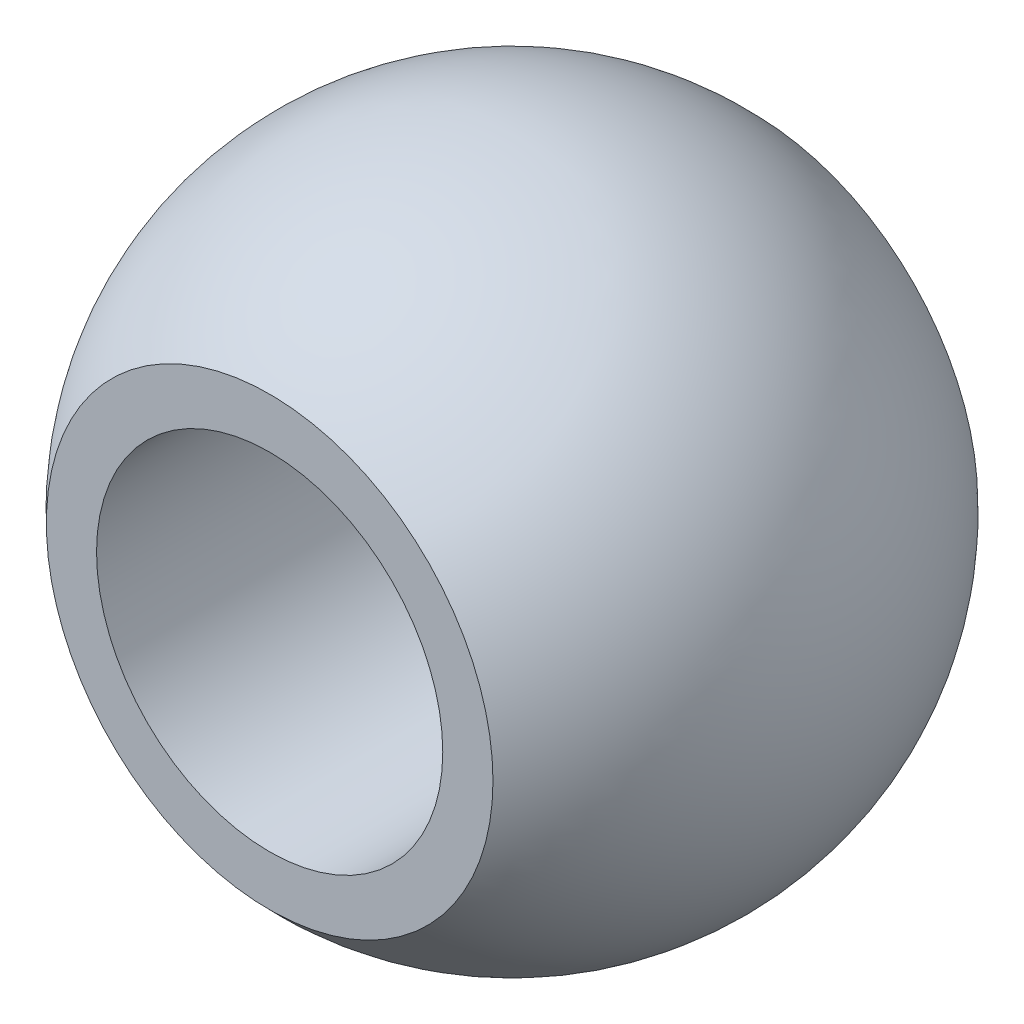
ISO-10303-21;
HEADER;
FILE_DESCRIPTION(('STEP AP214'),'2;1');
FILE_NAME('part.step','',(''),(''),'','','');
FILE_SCHEMA(('AUTOMOTIVE_DESIGN { 1 0 10303 214 1 1 1 1 }'));
ENDSEC;
DATA;
#1=APPLICATION_CONTEXT('core data for automotive mechanical design processes');
#2=APPLICATION_PROTOCOL_DEFINITION('international standard','automotive_design',2000,#1);
#3=PRODUCT_CONTEXT('',#1,'mechanical');
#4=PRODUCT('Part','Part','',(#3));
#5=PRODUCT_RELATED_PRODUCT_CATEGORY('part','',(#4));
#6=PRODUCT_DEFINITION_FORMATION('','',#4);
#7=PRODUCT_DEFINITION_CONTEXT('part definition',#1,'design');
#8=PRODUCT_DEFINITION('design','',#6,#7);
#9=PRODUCT_DEFINITION_SHAPE('','',#8);
#10=(LENGTH_UNIT() NAMED_UNIT(*) SI_UNIT(.MILLI.,.METRE.));
#11=(NAMED_UNIT(*) PLANE_ANGLE_UNIT() SI_UNIT($,.RADIAN.));
#12=(NAMED_UNIT(*) SI_UNIT($,.STERADIAN.) SOLID_ANGLE_UNIT());
#13=UNCERTAINTY_MEASURE_WITH_UNIT(LENGTH_MEASURE(1.E-05),#10,'distance_accuracy_value','');
#14=(GEOMETRIC_REPRESENTATION_CONTEXT(3) GLOBAL_UNCERTAINTY_ASSIGNED_CONTEXT((#13)) GLOBAL_UNIT_ASSIGNED_CONTEXT((#10,
#11,#12)) REPRESENTATION_CONTEXT('',''));
#15=CARTESIAN_POINT('',(0.,0.,0.));
#16=DIRECTION('',(0.,0.,1.));
#17=DIRECTION('',(1.,0.,0.));
#18=AXIS2_PLACEMENT_3D('',#15,#16,#17);
#19=CARTESIAN_POINT('',(0.,0.,0.));
#20=DIRECTION('',(0.,0.,1.));
#21=DIRECTION('',(0.,-1.,0.));
#22=AXIS2_PLACEMENT_3D('',#19,#20,#21);
#23=SPHERICAL_SURFACE('',#22,9.51853455107455);
#24=CARTESIAN_POINT('',(0.,0.,-7.));
#25=DIRECTION('',(0.,0.,1.));
#26=DIRECTION('',(1.,0.,0.));
#27=AXIS2_PLACEMENT_3D('',#24,#25,#26);
#28=CIRCLE('',#27,6.45);
#29=CARTESIAN_POINT('',(6.45,0.,-7.));
#30=VERTEX_POINT('',#29);
#31=EDGE_CURVE('E51',#30,#30,#28,.T.);
#32=ORIENTED_EDGE('',*,*,#31,.T.);
#33=EDGE_LOOP('',(#32));
#34=FACE_BOUND('',#33,.T.);
#35=CARTESIAN_POINT('',(0.,0.,7.));
#36=DIRECTION('',(0.,0.,1.));
#37=DIRECTION('',(1.,0.,0.));
#38=AXIS2_PLACEMENT_3D('',#35,#36,#37);
#39=CIRCLE('',#38,6.45);
#40=CARTESIAN_POINT('',(6.45,0.,7.));
#41=VERTEX_POINT('',#40);
#42=EDGE_CURVE('E10',#41,#41,#39,.T.);
#43=ORIENTED_EDGE('',*,*,#42,.F.);
#44=EDGE_LOOP('',(#43));
#45=FACE_BOUND('',#44,.T.);
#46=ADVANCED_FACE('F37',(#34,#45),#23,.T.);
#47=CARTESIAN_POINT('',(0.,-6.45,7.));
#48=DIRECTION('',(0.,0.,1.));
#49=DIRECTION('',(1.,0.,0.));
#50=AXIS2_PLACEMENT_3D('',#47,#48,#49);
#51=PLANE('',#50);
#52=ORIENTED_EDGE('',*,*,#42,.T.);
#53=EDGE_LOOP('',(#52));
#54=FACE_BOUND('',#53,.T.);
#55=CARTESIAN_POINT('',(0.,0.,7.));
#56=DIRECTION('',(0.,0.,1.));
#57=DIRECTION('',(1.,0.,0.));
#58=AXIS2_PLACEMENT_3D('',#55,#56,#57);
#59=CIRCLE('',#58,5.);
#60=CARTESIAN_POINT('',(5.,0.,7.));
#61=VERTEX_POINT('',#60);
#62=EDGE_CURVE('E43',#61,#61,#59,.T.);
#63=ORIENTED_EDGE('',*,*,#62,.F.);
#64=EDGE_LOOP('',(#63));
#65=FACE_BOUND('',#64,.T.);
#66=ADVANCED_FACE('F67',(#54,#65),#51,.T.);
#67=CARTESIAN_POINT('',(0.,0.,4.63520643450665));
#68=DIRECTION('',(0.,0.,1.));
#69=DIRECTION('',(1.,0.,0.));
#70=AXIS2_PLACEMENT_3D('',#67,#68,#69);
#71=CYLINDRICAL_SURFACE('',#70,5.);
#72=ORIENTED_EDGE('',*,*,#62,.T.);
#73=EDGE_LOOP('',(#72));
#74=FACE_BOUND('',#73,.T.);
#75=CARTESIAN_POINT('',(0.,0.,-7.));
#76=DIRECTION('',(0.,0.,1.));
#77=DIRECTION('',(1.,0.,0.));
#78=AXIS2_PLACEMENT_3D('',#75,#76,#77);
#79=CIRCLE('',#78,5.);
#80=CARTESIAN_POINT('',(5.,0.,-7.));
#81=VERTEX_POINT('',#80);
#82=EDGE_CURVE('E47',#81,#81,#79,.T.);
#83=ORIENTED_EDGE('',*,*,#82,.F.);
#84=EDGE_LOOP('',(#83));
#85=FACE_BOUND('',#84,.T.);
#86=ADVANCED_FACE('F61',(#74,#85),#71,.F.);
#87=CARTESIAN_POINT('',(0.,-5.,-7.));
#88=DIRECTION('',(0.,0.,-1.));
#89=DIRECTION('',(-1.,0.,0.));
#90=AXIS2_PLACEMENT_3D('',#87,#88,#89);
#91=PLANE('',#90);
#92=ORIENTED_EDGE('',*,*,#82,.T.);
#93=EDGE_LOOP('',(#92));
#94=FACE_BOUND('',#93,.T.);
#95=ORIENTED_EDGE('',*,*,#31,.F.);
#96=EDGE_LOOP('',(#95));
#97=FACE_BOUND('',#96,.T.);
#98=ADVANCED_FACE('F59',(#94,#97),#91,.T.);
#99=CLOSED_SHELL('',(#46,#66,#86,#98));
#100=MANIFOLD_SOLID_BREP('B2',#99);
#101=ADVANCED_BREP_SHAPE_REPRESENTATION('',(#18,#100),#14);
#102=SHAPE_DEFINITION_REPRESENTATION(#9,#101);
ENDSEC;
END-ISO-10303-21;
